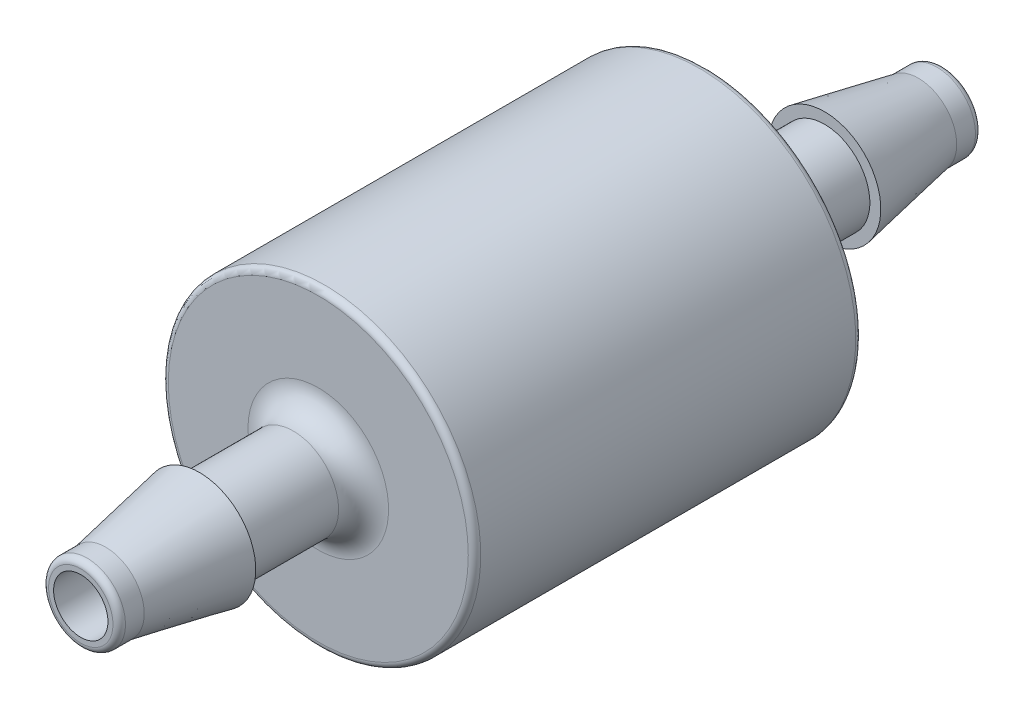
ISO-10303-21;
HEADER;
FILE_DESCRIPTION(('STEP AP214'),'2;1');
FILE_NAME('part.step','',(''),(''),'','','');
FILE_SCHEMA(('AUTOMOTIVE_DESIGN { 1 0 10303 214 1 1 1 1 }'));
ENDSEC;
DATA;
#1=APPLICATION_CONTEXT('core data for automotive mechanical design processes');
#2=APPLICATION_PROTOCOL_DEFINITION('international standard','automotive_design',2000,#1);
#3=PRODUCT_CONTEXT('',#1,'mechanical');
#4=PRODUCT('Part','Part','',(#3));
#5=PRODUCT_RELATED_PRODUCT_CATEGORY('part','',(#4));
#6=PRODUCT_DEFINITION_FORMATION('','',#4);
#7=PRODUCT_DEFINITION_CONTEXT('part definition',#1,'design');
#8=PRODUCT_DEFINITION('design','',#6,#7);
#9=PRODUCT_DEFINITION_SHAPE('','',#8);
#10=(LENGTH_UNIT() NAMED_UNIT(*) SI_UNIT(.MILLI.,.METRE.));
#11=(NAMED_UNIT(*) PLANE_ANGLE_UNIT() SI_UNIT($,.RADIAN.));
#12=(NAMED_UNIT(*) SI_UNIT($,.STERADIAN.) SOLID_ANGLE_UNIT());
#13=UNCERTAINTY_MEASURE_WITH_UNIT(LENGTH_MEASURE(1.E-05),#10,'distance_accuracy_value','');
#14=(GEOMETRIC_REPRESENTATION_CONTEXT(3) GLOBAL_UNCERTAINTY_ASSIGNED_CONTEXT((#13)) GLOBAL_UNIT_ASSIGNED_CONTEXT((#10,
#11,#12)) REPRESENTATION_CONTEXT('',''));
#15=CARTESIAN_POINT('',(0.,0.,0.));
#16=DIRECTION('',(0.,0.,1.));
#17=DIRECTION('',(1.,0.,0.));
#18=AXIS2_PLACEMENT_3D('',#15,#16,#17);
#19=CARTESIAN_POINT('',(0.,-2.286,12.7));
#20=DIRECTION('',(0.,0.,-1.));
#21=DIRECTION('',(-1.,0.,0.));
#22=AXIS2_PLACEMENT_3D('',#19,#20,#21);
#23=PLANE('',#22);
#24=CARTESIAN_POINT('',(0.,0.,12.7));
#25=DIRECTION('',(0.,0.,-1.));
#26=DIRECTION('',(-1.,0.,0.));
#27=AXIS2_PLACEMENT_3D('',#24,#25,#26);
#28=CIRCLE('',#27,2.28599999999999);
#29=CARTESIAN_POINT('',(-2.28599999999999,0.,12.7));
#30=VERTEX_POINT('',#29);
#31=EDGE_CURVE('E10',#30,#30,#28,.T.);
#32=ORIENTED_EDGE('',*,*,#31,.T.);
#33=EDGE_LOOP('',(#32));
#34=FACE_BOUND('',#33,.T.);
#35=CARTESIAN_POINT('',(0.,0.,12.7));
#36=DIRECTION('',(0.,0.,-1.));
#37=DIRECTION('',(-1.,0.,0.));
#38=AXIS2_PLACEMENT_3D('',#35,#36,#37);
#39=CIRCLE('',#38,1.84149999999999);
#40=CARTESIAN_POINT('',(-1.84149999999999,0.,12.7));
#41=VERTEX_POINT('',#40);
#42=EDGE_CURVE('E101',#41,#41,#39,.T.);
#43=ORIENTED_EDGE('',*,*,#42,.F.);
#44=EDGE_LOOP('',(#43));
#45=FACE_BOUND('',#44,.T.);
#46=ADVANCED_FACE('F37',(#34,#45),#23,.T.);
#47=CARTESIAN_POINT('',(0.,0.,12.7));
#48=DIRECTION('',(0.,0.,-1.));
#49=DIRECTION('',(-1.,0.,0.));
#50=AXIS2_PLACEMENT_3D('',#47,#48,#49);
#51=CONICAL_SURFACE('',#50,2.28599999999999,0.187761946513594);
#52=CARTESIAN_POINT('',(0.,0.,16.51));
#53=DIRECTION('',(0.,0.,-1.));
#54=DIRECTION('',(-1.,0.,0.));
#55=AXIS2_PLACEMENT_3D('',#52,#53,#54);
#56=CIRCLE('',#55,1.56209999999999);
#57=CARTESIAN_POINT('',(-1.56209999999999,0.,16.51));
#58=VERTEX_POINT('',#57);
#59=EDGE_CURVE('E43',#58,#58,#56,.T.);
#60=ORIENTED_EDGE('',*,*,#59,.T.);
#61=EDGE_LOOP('',(#60));
#62=FACE_BOUND('',#61,.T.);
#63=ORIENTED_EDGE('',*,*,#31,.F.);
#64=EDGE_LOOP('',(#63));
#65=FACE_BOUND('',#64,.T.);
#66=ADVANCED_FACE('F109',(#62,#65),#51,.T.);
#67=CARTESIAN_POINT('',(0.,0.,-17.526));
#68=DIRECTION('',(0.,0.,-1.));
#69=DIRECTION('',(-1.,0.,0.));
#70=AXIS2_PLACEMENT_3D('',#67,#68,#69);
#71=CYLINDRICAL_SURFACE('',#70,1.56209999999999);
#72=CARTESIAN_POINT('',(0.,0.,17.272));
#73=DIRECTION('',(0.,0.,-1.));
#74=DIRECTION('',(-1.,0.,0.));
#75=AXIS2_PLACEMENT_3D('',#72,#73,#74);
#76=CIRCLE('',#75,1.56209999999999);
#77=CARTESIAN_POINT('',(-1.56209999999999,0.,17.272));
#78=VERTEX_POINT('',#77);
#79=EDGE_CURVE('E47',#78,#78,#76,.T.);
#80=ORIENTED_EDGE('',*,*,#79,.T.);
#81=EDGE_LOOP('',(#80));
#82=FACE_BOUND('',#81,.T.);
#83=ORIENTED_EDGE('',*,*,#59,.F.);
#84=EDGE_LOOP('',(#83));
#85=FACE_BOUND('',#84,.T.);
#86=ADVANCED_FACE('F113',(#82,#85),#71,.T.);
#87=CARTESIAN_POINT('',(0.,0.,17.272));
#88=DIRECTION('',(0.,0.,-1.));
#89=DIRECTION('',(-1.,0.,0.));
#90=AXIS2_PLACEMENT_3D('',#87,#88,#89);
#91=TOROIDAL_SURFACE('',#90,1.30809999999999,0.254000000000004);
#92=CARTESIAN_POINT('',(0.,0.,17.526));
#93=DIRECTION('',(0.,0.,-1.));
#94=DIRECTION('',(-1.,0.,0.));
#95=AXIS2_PLACEMENT_3D('',#92,#93,#94);
#96=CIRCLE('',#95,1.30809999999999);
#97=CARTESIAN_POINT('',(-1.30809999999999,0.,17.526));
#98=VERTEX_POINT('',#97);
#99=EDGE_CURVE('E51',#98,#98,#96,.T.);
#100=ORIENTED_EDGE('',*,*,#99,.T.);
#101=EDGE_LOOP('',(#100));
#102=FACE_BOUND('',#101,.T.);
#103=ORIENTED_EDGE('',*,*,#79,.F.);
#104=EDGE_LOOP('',(#103));
#105=FACE_BOUND('',#104,.T.);
#106=ADVANCED_FACE('F117',(#102,#105),#91,.T.);
#107=CARTESIAN_POINT('',(0.,-1.1049,17.526));
#108=DIRECTION('',(0.,0.,1.));
#109=DIRECTION('',(1.,0.,0.));
#110=AXIS2_PLACEMENT_3D('',#107,#108,#109);
#111=PLANE('',#110);
#112=CARTESIAN_POINT('',(0.,0.,17.526));
#113=DIRECTION('',(0.,0.,-1.));
#114=DIRECTION('',(-1.,0.,0.));
#115=AXIS2_PLACEMENT_3D('',#112,#113,#114);
#116=CIRCLE('',#115,1.10489999999999);
#117=CARTESIAN_POINT('',(-1.10489999999999,0.,17.526));
#118=VERTEX_POINT('',#117);
#119=EDGE_CURVE('E56',#118,#118,#116,.T.);
#120=ORIENTED_EDGE('',*,*,#119,.T.);
#121=EDGE_LOOP('',(#120));
#122=FACE_BOUND('',#121,.T.);
#123=ORIENTED_EDGE('',*,*,#99,.F.);
#124=EDGE_LOOP('',(#123));
#125=FACE_BOUND('',#124,.T.);
#126=ADVANCED_FACE('F124',(#122,#125),#111,.T.);
#127=CARTESIAN_POINT('',(0.,0.,-17.526));
#128=DIRECTION('',(0.,0.,-1.));
#129=DIRECTION('',(-1.,0.,0.));
#130=AXIS2_PLACEMENT_3D('',#127,#128,#129);
#131=CYLINDRICAL_SURFACE('',#130,1.10489999999999);
#132=CARTESIAN_POINT('',(0.,0.,-17.526));
#133=DIRECTION('',(0.,0.,-1.));
#134=DIRECTION('',(-1.,0.,0.));
#135=AXIS2_PLACEMENT_3D('',#132,#133,#134);
#136=CIRCLE('',#135,1.10489999999999);
#137=CARTESIAN_POINT('',(-1.10489999999999,0.,-17.526));
#138=VERTEX_POINT('',#137);
#139=EDGE_CURVE('E59',#138,#138,#136,.T.);
#140=ORIENTED_EDGE('',*,*,#139,.T.);
#141=EDGE_LOOP('',(#140));
#142=FACE_BOUND('',#141,.T.);
#143=ORIENTED_EDGE('',*,*,#119,.F.);
#144=EDGE_LOOP('',(#143));
#145=FACE_BOUND('',#144,.T.);
#146=ADVANCED_FACE('F128',(#142,#145),#131,.F.);
#147=CARTESIAN_POINT('',(0.,-1.1049,-17.526));
#148=DIRECTION('',(0.,0.,-1.));
#149=DIRECTION('',(-1.,0.,0.));
#150=AXIS2_PLACEMENT_3D('',#147,#148,#149);
#151=PLANE('',#150);
#152=CARTESIAN_POINT('',(0.,0.,-17.526));
#153=DIRECTION('',(0.,0.,-1.));
#154=DIRECTION('',(-1.,0.,0.));
#155=AXIS2_PLACEMENT_3D('',#152,#153,#154);
#156=CIRCLE('',#155,1.30809999999999);
#157=CARTESIAN_POINT('',(-1.30809999999999,0.,-17.526));
#158=VERTEX_POINT('',#157);
#159=EDGE_CURVE('E62',#158,#158,#156,.T.);
#160=ORIENTED_EDGE('',*,*,#159,.T.);
#161=EDGE_LOOP('',(#160));
#162=FACE_BOUND('',#161,.T.);
#163=ORIENTED_EDGE('',*,*,#139,.F.);
#164=EDGE_LOOP('',(#163));
#165=FACE_BOUND('',#164,.T.);
#166=ADVANCED_FACE('F132',(#162,#165),#151,.T.);
#167=CARTESIAN_POINT('',(0.,0.,-17.272));
#168=DIRECTION('',(0.,0.,-1.));
#169=DIRECTION('',(-1.,0.,0.));
#170=AXIS2_PLACEMENT_3D('',#167,#168,#169);
#171=TOROIDAL_SURFACE('',#170,1.30809999999999,0.254000000000007);
#172=CARTESIAN_POINT('',(0.,0.,-17.272));
#173=DIRECTION('',(0.,0.,-1.));
#174=DIRECTION('',(-1.,0.,0.));
#175=AXIS2_PLACEMENT_3D('',#172,#173,#174);
#176=CIRCLE('',#175,1.5621);
#177=CARTESIAN_POINT('',(-1.5621,0.,-17.272));
#178=VERTEX_POINT('',#177);
#179=EDGE_CURVE('E65',#178,#178,#176,.T.);
#180=ORIENTED_EDGE('',*,*,#179,.T.);
#181=EDGE_LOOP('',(#180));
#182=FACE_BOUND('',#181,.T.);
#183=ORIENTED_EDGE('',*,*,#159,.F.);
#184=EDGE_LOOP('',(#183));
#185=FACE_BOUND('',#184,.T.);
#186=ADVANCED_FACE('F136',(#182,#185),#171,.T.);
#187=CARTESIAN_POINT('',(0.,0.,-17.526));
#188=DIRECTION('',(0.,0.,-1.));
#189=DIRECTION('',(-1.,0.,0.));
#190=AXIS2_PLACEMENT_3D('',#187,#188,#189);
#191=CYLINDRICAL_SURFACE('',#190,1.56209999999999);
#192=CARTESIAN_POINT('',(0.,0.,-16.51));
#193=DIRECTION('',(0.,0.,-1.));
#194=DIRECTION('',(-1.,0.,0.));
#195=AXIS2_PLACEMENT_3D('',#192,#193,#194);
#196=CIRCLE('',#195,1.56209999999999);
#197=CARTESIAN_POINT('',(-1.56209999999999,0.,-16.51));
#198=VERTEX_POINT('',#197);
#199=EDGE_CURVE('E68',#198,#198,#196,.T.);
#200=ORIENTED_EDGE('',*,*,#199,.T.);
#201=EDGE_LOOP('',(#200));
#202=FACE_BOUND('',#201,.T.);
#203=ORIENTED_EDGE('',*,*,#179,.F.);
#204=EDGE_LOOP('',(#203));
#205=FACE_BOUND('',#204,.T.);
#206=ADVANCED_FACE('F140',(#202,#205),#191,.T.);
#207=CARTESIAN_POINT('',(0.,0.,-16.51));
#208=DIRECTION('',(0.,0.,1.));
#209=DIRECTION('',(1.,0.,0.));
#210=AXIS2_PLACEMENT_3D('',#207,#208,#209);
#211=CONICAL_SURFACE('',#210,1.56209999999999,0.187761946513594);
#212=CARTESIAN_POINT('',(0.,0.,-12.7));
#213=DIRECTION('',(0.,0.,-1.));
#214=DIRECTION('',(-1.,0.,0.));
#215=AXIS2_PLACEMENT_3D('',#212,#213,#214);
#216=CIRCLE('',#215,2.28599999999999);
#217=CARTESIAN_POINT('',(-2.28599999999999,0.,-12.7));
#218=VERTEX_POINT('',#217);
#219=EDGE_CURVE('E71',#218,#218,#216,.T.);
#220=ORIENTED_EDGE('',*,*,#219,.T.);
#221=EDGE_LOOP('',(#220));
#222=FACE_BOUND('',#221,.T.);
#223=ORIENTED_EDGE('',*,*,#199,.F.);
#224=EDGE_LOOP('',(#223));
#225=FACE_BOUND('',#224,.T.);
#226=ADVANCED_FACE('F144',(#222,#225),#211,.T.);
#227=CARTESIAN_POINT('',(0.,-2.286,-12.7));
#228=DIRECTION('',(0.,0.,1.));
#229=DIRECTION('',(1.,0.,0.));
#230=AXIS2_PLACEMENT_3D('',#227,#228,#229);
#231=PLANE('',#230);
#232=CARTESIAN_POINT('',(0.,0.,-12.7));
#233=DIRECTION('',(0.,0.,-1.));
#234=DIRECTION('',(-1.,0.,0.));
#235=AXIS2_PLACEMENT_3D('',#232,#233,#234);
#236=CIRCLE('',#235,1.84149999999999);
#237=CARTESIAN_POINT('',(-1.84149999999999,0.,-12.7));
#238=VERTEX_POINT('',#237);
#239=EDGE_CURVE('E74',#238,#238,#236,.T.);
#240=ORIENTED_EDGE('',*,*,#239,.T.);
#241=EDGE_LOOP('',(#240));
#242=FACE_BOUND('',#241,.T.);
#243=ORIENTED_EDGE('',*,*,#219,.F.);
#244=EDGE_LOOP('',(#243));
#245=FACE_BOUND('',#244,.T.);
#246=ADVANCED_FACE('F148',(#242,#245),#231,.T.);
#247=CARTESIAN_POINT('',(0.,0.,-17.526));
#248=DIRECTION('',(0.,0.,-1.));
#249=DIRECTION('',(-1.,0.,0.));
#250=AXIS2_PLACEMENT_3D('',#247,#248,#249);
#251=CYLINDRICAL_SURFACE('',#250,1.84149999999999);
#252=CARTESIAN_POINT('',(0.,0.,-8.89000000000001));
#253=DIRECTION('',(0.,0.,-1.));
#254=DIRECTION('',(-1.,0.,0.));
#255=AXIS2_PLACEMENT_3D('',#252,#253,#254);
#256=CIRCLE('',#255,1.84149999999999);
#257=CARTESIAN_POINT('',(-1.84149999999999,0.,-8.89000000000001));
#258=VERTEX_POINT('',#257);
#259=EDGE_CURVE('E77',#258,#258,#256,.T.);
#260=ORIENTED_EDGE('',*,*,#259,.T.);
#261=EDGE_LOOP('',(#260));
#262=FACE_BOUND('',#261,.T.);
#263=ORIENTED_EDGE('',*,*,#239,.F.);
#264=EDGE_LOOP('',(#263));
#265=FACE_BOUND('',#264,.T.);
#266=ADVANCED_FACE('F152',(#262,#265),#251,.T.);
#267=CARTESIAN_POINT('',(0.,0.,-8.89000000000001));
#268=DIRECTION('',(0.,0.,-1.));
#269=DIRECTION('',(-1.,0.,0.));
#270=AXIS2_PLACEMENT_3D('',#267,#268,#269);
#271=TOROIDAL_SURFACE('',#270,2.85749999999999,1.016);
#272=CARTESIAN_POINT('',(0.,0.,-7.87400000000001));
#273=DIRECTION('',(0.,0.,-1.));
#274=DIRECTION('',(-1.,0.,0.));
#275=AXIS2_PLACEMENT_3D('',#272,#273,#274);
#276=CIRCLE('',#275,2.85749999999999);
#277=CARTESIAN_POINT('',(-2.85749999999999,0.,-7.87400000000001));
#278=VERTEX_POINT('',#277);
#279=EDGE_CURVE('E80',#278,#278,#276,.T.);
#280=ORIENTED_EDGE('',*,*,#279,.T.);
#281=EDGE_LOOP('',(#280));
#282=FACE_BOUND('',#281,.T.);
#283=ORIENTED_EDGE('',*,*,#259,.F.);
#284=EDGE_LOOP('',(#283));
#285=FACE_BOUND('',#284,.T.);
#286=ADVANCED_FACE('F156',(#282,#285),#271,.F.);
#287=CARTESIAN_POINT('',(0.,-2.85749999999999,-7.87400000000001));
#288=DIRECTION('',(0.,0.,-1.));
#289=DIRECTION('',(-1.,0.,0.));
#290=AXIS2_PLACEMENT_3D('',#287,#288,#289);
#291=PLANE('',#290);
#292=CARTESIAN_POINT('',(0.,0.,-7.87400000000001));
#293=DIRECTION('',(0.,0.,-1.));
#294=DIRECTION('',(-1.,0.,0.));
#295=AXIS2_PLACEMENT_3D('',#292,#293,#294);
#296=CIRCLE('',#295,6.09599999999999);
#297=CARTESIAN_POINT('',(-6.09599999999999,0.,-7.87400000000001));
#298=VERTEX_POINT('',#297);
#299=EDGE_CURVE('E83',#298,#298,#296,.T.);
#300=ORIENTED_EDGE('',*,*,#299,.T.);
#301=EDGE_LOOP('',(#300));
#302=FACE_BOUND('',#301,.T.);
#303=ORIENTED_EDGE('',*,*,#279,.F.);
#304=EDGE_LOOP('',(#303));
#305=FACE_BOUND('',#304,.T.);
#306=ADVANCED_FACE('F160',(#302,#305),#291,.T.);
#307=CARTESIAN_POINT('',(0.,0.,-7.62000000000001));
#308=DIRECTION('',(0.,0.,-1.));
#309=DIRECTION('',(-1.,0.,0.));
#310=AXIS2_PLACEMENT_3D('',#307,#308,#309);
#311=TOROIDAL_SURFACE('',#310,6.09599999999999,0.253999999999999);
#312=CARTESIAN_POINT('',(0.,0.,-7.62000000000001));
#313=DIRECTION('',(0.,0.,-1.));
#314=DIRECTION('',(-1.,0.,0.));
#315=AXIS2_PLACEMENT_3D('',#312,#313,#314);
#316=CIRCLE('',#315,6.34999999999999);
#317=CARTESIAN_POINT('',(-6.34999999999999,0.,-7.62000000000001));
#318=VERTEX_POINT('',#317);
#319=EDGE_CURVE('E86',#318,#318,#316,.T.);
#320=ORIENTED_EDGE('',*,*,#319,.T.);
#321=EDGE_LOOP('',(#320));
#322=FACE_BOUND('',#321,.T.);
#323=ORIENTED_EDGE('',*,*,#299,.F.);
#324=EDGE_LOOP('',(#323));
#325=FACE_BOUND('',#324,.T.);
#326=ADVANCED_FACE('F164',(#322,#325),#311,.T.);
#327=CARTESIAN_POINT('',(0.,0.,-17.526));
#328=DIRECTION('',(0.,0.,-1.));
#329=DIRECTION('',(-1.,0.,0.));
#330=AXIS2_PLACEMENT_3D('',#327,#328,#329);
#331=CYLINDRICAL_SURFACE('',#330,6.34999999999999);
#332=CARTESIAN_POINT('',(0.,0.,7.62));
#333=DIRECTION('',(0.,0.,-1.));
#334=DIRECTION('',(-1.,0.,0.));
#335=AXIS2_PLACEMENT_3D('',#332,#333,#334);
#336=CIRCLE('',#335,6.34999999999999);
#337=CARTESIAN_POINT('',(-6.34999999999999,0.,7.62));
#338=VERTEX_POINT('',#337);
#339=EDGE_CURVE('E89',#338,#338,#336,.T.);
#340=ORIENTED_EDGE('',*,*,#339,.T.);
#341=EDGE_LOOP('',(#340));
#342=FACE_BOUND('',#341,.T.);
#343=ORIENTED_EDGE('',*,*,#319,.F.);
#344=EDGE_LOOP('',(#343));
#345=FACE_BOUND('',#344,.T.);
#346=ADVANCED_FACE('F168',(#342,#345),#331,.T.);
#347=CARTESIAN_POINT('',(0.,0.,7.62));
#348=DIRECTION('',(0.,0.,-1.));
#349=DIRECTION('',(-1.,0.,0.));
#350=AXIS2_PLACEMENT_3D('',#347,#348,#349);
#351=TOROIDAL_SURFACE('',#350,6.09599999999999,0.253999999999999);
#352=CARTESIAN_POINT('',(0.,0.,7.874));
#353=DIRECTION('',(0.,0.,-1.));
#354=DIRECTION('',(-1.,0.,0.));
#355=AXIS2_PLACEMENT_3D('',#352,#353,#354);
#356=CIRCLE('',#355,6.09599999999999);
#357=CARTESIAN_POINT('',(-6.09599999999999,0.,7.874));
#358=VERTEX_POINT('',#357);
#359=EDGE_CURVE('E92',#358,#358,#356,.T.);
#360=ORIENTED_EDGE('',*,*,#359,.T.);
#361=EDGE_LOOP('',(#360));
#362=FACE_BOUND('',#361,.T.);
#363=ORIENTED_EDGE('',*,*,#339,.F.);
#364=EDGE_LOOP('',(#363));
#365=FACE_BOUND('',#364,.T.);
#366=ADVANCED_FACE('F172',(#362,#365),#351,.T.);
#367=CARTESIAN_POINT('',(0.,-2.85749999999999,7.874));
#368=DIRECTION('',(0.,0.,1.));
#369=DIRECTION('',(1.,0.,0.));
#370=AXIS2_PLACEMENT_3D('',#367,#368,#369);
#371=PLANE('',#370);
#372=CARTESIAN_POINT('',(0.,0.,7.87400000000001));
#373=DIRECTION('',(0.,0.,-1.));
#374=DIRECTION('',(-1.,0.,0.));
#375=AXIS2_PLACEMENT_3D('',#372,#373,#374);
#376=CIRCLE('',#375,2.85749999999999);
#377=CARTESIAN_POINT('',(-2.85749999999999,0.,7.87400000000001));
#378=VERTEX_POINT('',#377);
#379=EDGE_CURVE('E95',#378,#378,#376,.T.);
#380=ORIENTED_EDGE('',*,*,#379,.T.);
#381=EDGE_LOOP('',(#380));
#382=FACE_BOUND('',#381,.T.);
#383=ORIENTED_EDGE('',*,*,#359,.F.);
#384=EDGE_LOOP('',(#383));
#385=FACE_BOUND('',#384,.T.);
#386=ADVANCED_FACE('F176',(#382,#385),#371,.T.);
#387=CARTESIAN_POINT('',(0.,0.,8.89));
#388=DIRECTION('',(0.,0.,-1.));
#389=DIRECTION('',(-1.,0.,0.));
#390=AXIS2_PLACEMENT_3D('',#387,#388,#389);
#391=TOROIDAL_SURFACE('',#390,2.85749999999999,1.016);
#392=CARTESIAN_POINT('',(0.,0.,8.89));
#393=DIRECTION('',(0.,0.,-1.));
#394=DIRECTION('',(-1.,0.,0.));
#395=AXIS2_PLACEMENT_3D('',#392,#393,#394);
#396=CIRCLE('',#395,1.84149999999999);
#397=CARTESIAN_POINT('',(-1.84149999999999,0.,8.89));
#398=VERTEX_POINT('',#397);
#399=EDGE_CURVE('E98',#398,#398,#396,.T.);
#400=ORIENTED_EDGE('',*,*,#399,.T.);
#401=EDGE_LOOP('',(#400));
#402=FACE_BOUND('',#401,.T.);
#403=ORIENTED_EDGE('',*,*,#379,.F.);
#404=EDGE_LOOP('',(#403));
#405=FACE_BOUND('',#404,.T.);
#406=ADVANCED_FACE('F180',(#402,#405),#391,.F.);
#407=CARTESIAN_POINT('',(0.,0.,-17.526));
#408=DIRECTION('',(0.,0.,-1.));
#409=DIRECTION('',(-1.,0.,0.));
#410=AXIS2_PLACEMENT_3D('',#407,#408,#409);
#411=CYLINDRICAL_SURFACE('',#410,1.84149999999999);
#412=ORIENTED_EDGE('',*,*,#42,.T.);
#413=EDGE_LOOP('',(#412));
#414=FACE_BOUND('',#413,.T.);
#415=ORIENTED_EDGE('',*,*,#399,.F.);
#416=EDGE_LOOP('',(#415));
#417=FACE_BOUND('',#416,.T.);
#418=ADVANCED_FACE('F105',(#414,#417),#411,.T.);
#419=CLOSED_SHELL('',(#46,#66,#86,#106,#126,#146,#166,#186,#206,#226,#246,#266,#286,#306,#326,
#346,#366,#386,#406,#418));
#420=MANIFOLD_SOLID_BREP('B2',#419);
#421=ADVANCED_BREP_SHAPE_REPRESENTATION('',(#18,#420),#14);
#422=SHAPE_DEFINITION_REPRESENTATION(#9,#421);
ENDSEC;
END-ISO-10303-21;
